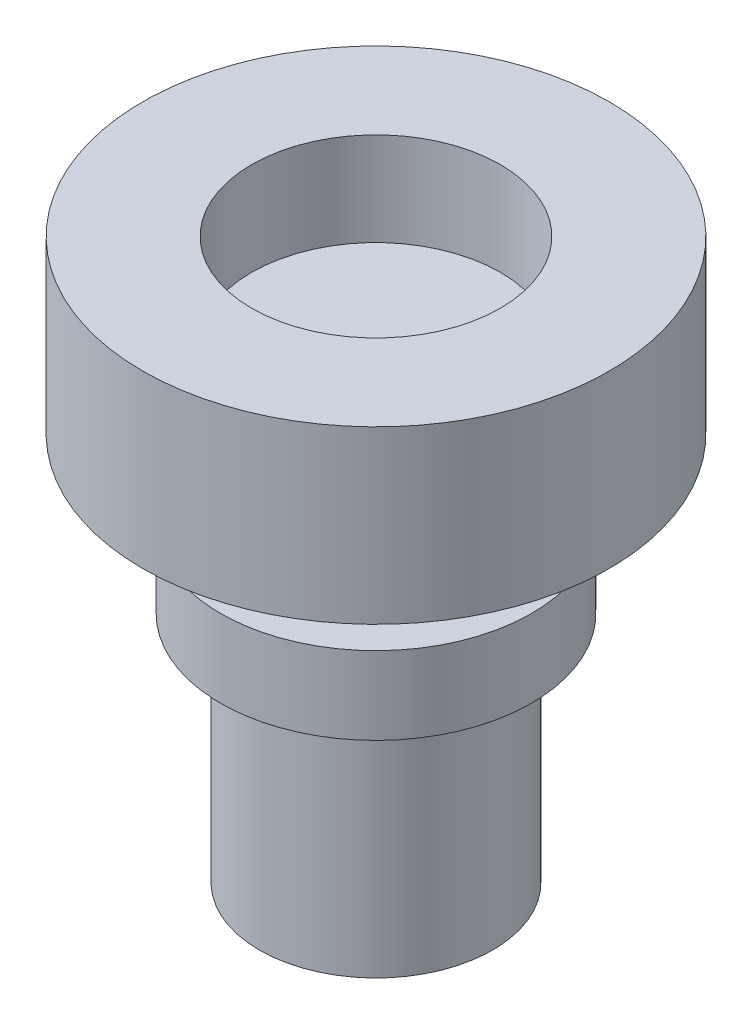
ISO-10303-21;
HEADER;
FILE_DESCRIPTION(('STEP AP214'),'2;1');
FILE_NAME('part.step','',(''),(''),'','','');
FILE_SCHEMA(('AUTOMOTIVE_DESIGN { 1 0 10303 214 1 1 1 1 }'));
ENDSEC;
DATA;
#1=APPLICATION_CONTEXT('core data for automotive mechanical design processes');
#2=APPLICATION_PROTOCOL_DEFINITION('international standard','automotive_design',2000,#1);
#3=PRODUCT_CONTEXT('',#1,'mechanical');
#4=PRODUCT('Part','Part','',(#3));
#5=PRODUCT_RELATED_PRODUCT_CATEGORY('part','',(#4));
#6=PRODUCT_DEFINITION_FORMATION('','',#4);
#7=PRODUCT_DEFINITION_CONTEXT('part definition',#1,'design');
#8=PRODUCT_DEFINITION('design','',#6,#7);
#9=PRODUCT_DEFINITION_SHAPE('','',#8);
#10=(LENGTH_UNIT() NAMED_UNIT(*) SI_UNIT(.MILLI.,.METRE.));
#11=(NAMED_UNIT(*) PLANE_ANGLE_UNIT() SI_UNIT($,.RADIAN.));
#12=(NAMED_UNIT(*) SI_UNIT($,.STERADIAN.) SOLID_ANGLE_UNIT());
#13=UNCERTAINTY_MEASURE_WITH_UNIT(LENGTH_MEASURE(1.E-05),#10,'distance_accuracy_value','');
#14=(GEOMETRIC_REPRESENTATION_CONTEXT(3) GLOBAL_UNCERTAINTY_ASSIGNED_CONTEXT((#13)) GLOBAL_UNIT_ASSIGNED_CONTEXT((#10,
#11,#12)) REPRESENTATION_CONTEXT('',''));
#15=CARTESIAN_POINT('',(0.,0.,0.));
#16=DIRECTION('',(0.,0.,1.));
#17=DIRECTION('',(1.,0.,0.));
#18=AXIS2_PLACEMENT_3D('',#15,#16,#17);
#19=CARTESIAN_POINT('',(-0.522013311509166,2.2,-0.51113803418606));
#20=DIRECTION('',(0.,1.,0.));
#21=DIRECTION('',(0.,0.,1.));
#22=AXIS2_PLACEMENT_3D('',#19,#20,#21);
#23=PLANE('',#22);
#24=CARTESIAN_POINT('',(-0.522013311509166,2.2,-0.51113803418606));
#25=DIRECTION('',(0.,1.,0.));
#26=DIRECTION('',(0.,0.,1.));
#27=AXIS2_PLACEMENT_3D('',#24,#25,#26);
#28=CIRCLE('',#27,3.);
#29=CARTESIAN_POINT('',(-0.522013311509166,2.2,2.48886196581394));
#30=VERTEX_POINT('',#29);
#31=EDGE_CURVE('E79',#30,#30,#28,.T.);
#32=ORIENTED_EDGE('',*,*,#31,.T.);
#33=EDGE_LOOP('',(#32));
#34=FACE_BOUND('',#33,.T.);
#35=CARTESIAN_POINT('',(-0.522013311509166,2.2,-0.51113803418606));
#36=DIRECTION('',(0.,1.,0.));
#37=DIRECTION('',(0.,0.,1.));
#38=AXIS2_PLACEMENT_3D('',#35,#36,#37);
#39=CIRCLE('',#38,1.6);
#40=CARTESIAN_POINT('',(-0.522013311509166,2.2,1.08886196581394));
#41=VERTEX_POINT('',#40);
#42=EDGE_CURVE('E73',#41,#41,#39,.T.);
#43=ORIENTED_EDGE('',*,*,#42,.F.);
#44=EDGE_LOOP('',(#43));
#45=FACE_BOUND('',#44,.T.);
#46=ADVANCED_FACE('F43',(#34,#45),#23,.T.);
#47=CARTESIAN_POINT('',(-0.522013311509166,0.,-0.51113803418606));
#48=DIRECTION('',(0.,1.,0.));
#49=DIRECTION('',(0.,0.,1.));
#50=AXIS2_PLACEMENT_3D('',#47,#48,#49);
#51=PLANE('',#50);
#52=CARTESIAN_POINT('',(-0.522013311509166,0.,-0.51113803418606));
#53=DIRECTION('',(0.,-1.,0.));
#54=DIRECTION('',(0.,0.,-1.));
#55=AXIS2_PLACEMENT_3D('',#52,#53,#54);
#56=CIRCLE('',#55,1.5);
#57=CARTESIAN_POINT('',(-0.522013311509166,0.,-2.01113803418606));
#58=VERTEX_POINT('',#57);
#59=EDGE_CURVE('E52',#58,#58,#56,.T.);
#60=ORIENTED_EDGE('',*,*,#59,.F.);
#61=EDGE_LOOP('',(#60));
#62=FACE_BOUND('',#61,.T.);
#63=CARTESIAN_POINT('',(-0.522013311509166,0.,-0.51113803418606));
#64=DIRECTION('',(0.,1.,0.));
#65=DIRECTION('',(0.,0.,1.));
#66=AXIS2_PLACEMENT_3D('',#63,#64,#65);
#67=CIRCLE('',#66,3.);
#68=CARTESIAN_POINT('',(-0.522013311509166,0.,2.48886196581394));
#69=VERTEX_POINT('',#68);
#70=EDGE_CURVE('E78',#69,#69,#67,.T.);
#71=ORIENTED_EDGE('',*,*,#70,.F.);
#72=EDGE_LOOP('',(#71));
#73=FACE_BOUND('',#72,.T.);
#74=ADVANCED_FACE('F87',(#62,#73),#51,.F.);
#75=CARTESIAN_POINT('',(-0.522013311509166,2.2,-0.51113803418606));
#76=DIRECTION('',(0.,-1.,0.));
#77=DIRECTION('',(0.,0.,-1.));
#78=AXIS2_PLACEMENT_3D('',#75,#76,#77);
#79=CYLINDRICAL_SURFACE('',#78,3.);
#80=ORIENTED_EDGE('',*,*,#31,.F.);
#81=EDGE_LOOP('',(#80));
#82=FACE_BOUND('',#81,.T.);
#83=ORIENTED_EDGE('',*,*,#70,.T.);
#84=EDGE_LOOP('',(#83));
#85=FACE_BOUND('',#84,.T.);
#86=ADVANCED_FACE('F45',(#82,#85),#79,.T.);
#87=CARTESIAN_POINT('',(-0.522013311509166,2.2,-0.51113803418606));
#88=DIRECTION('',(0.,-1.,0.));
#89=DIRECTION('',(0.,0.,-1.));
#90=AXIS2_PLACEMENT_3D('',#87,#88,#89);
#91=CYLINDRICAL_SURFACE('',#90,1.6);
#92=CARTESIAN_POINT('',(-0.522013311509166,1.,-0.51113803418606));
#93=DIRECTION('',(0.,1.,0.));
#94=DIRECTION('',(0.,0.,1.));
#95=AXIS2_PLACEMENT_3D('',#92,#93,#94);
#96=CIRCLE('',#95,1.6);
#97=CARTESIAN_POINT('',(-0.522013311509166,1.,1.08886196581394));
#98=VERTEX_POINT('',#97);
#99=EDGE_CURVE('E47',#98,#98,#96,.T.);
#100=ORIENTED_EDGE('',*,*,#99,.F.);
#101=EDGE_LOOP('',(#100));
#102=FACE_BOUND('',#101,.T.);
#103=ORIENTED_EDGE('',*,*,#42,.T.);
#104=EDGE_LOOP('',(#103));
#105=FACE_BOUND('',#104,.T.);
#106=ADVANCED_FACE('F94',(#102,#105),#91,.F.);
#107=CARTESIAN_POINT('',(0.,1.,0.));
#108=DIRECTION('',(0.,1.,0.));
#109=DIRECTION('',(0.,0.,1.));
#110=AXIS2_PLACEMENT_3D('',#107,#108,#109);
#111=PLANE('',#110);
#112=ORIENTED_EDGE('',*,*,#99,.T.);
#113=EDGE_LOOP('',(#112));
#114=FACE_BOUND('',#113,.T.);
#115=ADVANCED_FACE('F102',(#114),#111,.T.);
#116=CARTESIAN_POINT('',(-0.522013311509166,-1.,-0.51113803418606));
#117=DIRECTION('',(0.,1.,0.));
#118=DIRECTION('',(0.,0.,1.));
#119=AXIS2_PLACEMENT_3D('',#116,#117,#118);
#120=CYLINDRICAL_SURFACE('',#119,1.5);
#121=CARTESIAN_POINT('',(-0.522013311509166,-1.,-0.51113803418606));
#122=DIRECTION('',(0.,-1.,0.));
#123=DIRECTION('',(0.,0.,-1.));
#124=AXIS2_PLACEMENT_3D('',#121,#122,#123);
#125=CIRCLE('',#124,1.5);
#126=CARTESIAN_POINT('',(-0.522013311509166,-1.,-2.01113803418606));
#127=VERTEX_POINT('',#126);
#128=EDGE_CURVE('E66',#127,#127,#125,.T.);
#129=ORIENTED_EDGE('',*,*,#128,.F.);
#130=EDGE_LOOP('',(#129));
#131=FACE_BOUND('',#130,.T.);
#132=ORIENTED_EDGE('',*,*,#59,.T.);
#133=EDGE_LOOP('',(#132));
#134=FACE_BOUND('',#133,.T.);
#135=ADVANCED_FACE('F106',(#131,#134),#120,.T.);
#136=CARTESIAN_POINT('',(-0.522013311509166,-2.,-0.51113803418606));
#137=DIRECTION('',(0.,1.,0.));
#138=DIRECTION('',(0.,0.,1.));
#139=AXIS2_PLACEMENT_3D('',#136,#137,#138);
#140=CYLINDRICAL_SURFACE('',#139,2.);
#141=CARTESIAN_POINT('',(-0.522013311509166,-2.,-0.51113803418606));
#142=DIRECTION('',(0.,-1.,0.));
#143=DIRECTION('',(0.,0.,-1.));
#144=AXIS2_PLACEMENT_3D('',#141,#142,#143);
#145=CIRCLE('',#144,2.);
#146=CARTESIAN_POINT('',(-0.522013311509166,-2.,-2.51113803418606));
#147=VERTEX_POINT('',#146);
#148=EDGE_CURVE('E62',#147,#147,#145,.T.);
#149=ORIENTED_EDGE('',*,*,#148,.F.);
#150=EDGE_LOOP('',(#149));
#151=FACE_BOUND('',#150,.T.);
#152=CARTESIAN_POINT('',(-0.522013311509166,-1.,-0.51113803418606));
#153=DIRECTION('',(0.,-1.,0.));
#154=DIRECTION('',(0.,0.,-1.));
#155=AXIS2_PLACEMENT_3D('',#152,#153,#154);
#156=CIRCLE('',#155,2.);
#157=CARTESIAN_POINT('',(-0.522013311509166,-1.,-2.51113803418606));
#158=VERTEX_POINT('',#157);
#159=EDGE_CURVE('E67',#158,#158,#156,.T.);
#160=ORIENTED_EDGE('',*,*,#159,.T.);
#161=EDGE_LOOP('',(#160));
#162=FACE_BOUND('',#161,.T.);
#163=ADVANCED_FACE('F110',(#151,#162),#140,.T.);
#164=CARTESIAN_POINT('',(-0.522013311509166,-2.,-0.51113803418606));
#165=DIRECTION('',(0.,-1.,0.));
#166=DIRECTION('',(0.,0.,-1.));
#167=AXIS2_PLACEMENT_3D('',#164,#165,#166);
#168=PLANE('',#167);
#169=CARTESIAN_POINT('',(-0.522013311509166,-2.,-0.51113803418606));
#170=DIRECTION('',(0.,-1.,0.));
#171=DIRECTION('',(0.,0.,-1.));
#172=AXIS2_PLACEMENT_3D('',#169,#170,#171);
#173=CIRCLE('',#172,1.5);
#174=CARTESIAN_POINT('',(-0.522013311509166,-2.,-2.01113803418606));
#175=VERTEX_POINT('',#174);
#176=EDGE_CURVE('E10',#175,#175,#173,.T.);
#177=ORIENTED_EDGE('',*,*,#176,.F.);
#178=EDGE_LOOP('',(#177));
#179=FACE_BOUND('',#178,.T.);
#180=ORIENTED_EDGE('',*,*,#148,.T.);
#181=EDGE_LOOP('',(#180));
#182=FACE_BOUND('',#181,.T.);
#183=ADVANCED_FACE('F114',(#179,#182),#168,.T.);
#184=CARTESIAN_POINT('',(-0.522013311509166,-1.,-0.51113803418606));
#185=DIRECTION('',(0.,-1.,0.));
#186=DIRECTION('',(0.,0.,-1.));
#187=AXIS2_PLACEMENT_3D('',#184,#185,#186);
#188=PLANE('',#187);
#189=ORIENTED_EDGE('',*,*,#128,.T.);
#190=EDGE_LOOP('',(#189));
#191=FACE_BOUND('',#190,.T.);
#192=ORIENTED_EDGE('',*,*,#159,.F.);
#193=EDGE_LOOP('',(#192));
#194=FACE_BOUND('',#193,.T.);
#195=ADVANCED_FACE('F116',(#191,#194),#188,.F.);
#196=CARTESIAN_POINT('',(-0.522013311509166,-5.,-0.51113803418606));
#197=DIRECTION('',(0.,1.,0.));
#198=DIRECTION('',(0.,0.,1.));
#199=AXIS2_PLACEMENT_3D('',#196,#197,#198);
#200=CYLINDRICAL_SURFACE('',#199,1.5);
#201=CARTESIAN_POINT('',(-0.522013311509166,-5.,-0.51113803418606));
#202=DIRECTION('',(0.,-1.,0.));
#203=DIRECTION('',(0.,0.,-1.));
#204=AXIS2_PLACEMENT_3D('',#201,#202,#203);
#205=CIRCLE('',#204,1.5);
#206=CARTESIAN_POINT('',(-0.522013311509166,-5.,-2.01113803418606));
#207=VERTEX_POINT('',#206);
#208=EDGE_CURVE('E61',#207,#207,#205,.T.);
#209=ORIENTED_EDGE('',*,*,#208,.F.);
#210=EDGE_LOOP('',(#209));
#211=FACE_BOUND('',#210,.T.);
#212=ORIENTED_EDGE('',*,*,#176,.T.);
#213=EDGE_LOOP('',(#212));
#214=FACE_BOUND('',#213,.T.);
#215=ADVANCED_FACE('F119',(#211,#214),#200,.T.);
#216=CARTESIAN_POINT('',(-0.522013311509166,-5.,-0.51113803418606));
#217=DIRECTION('',(0.,-1.,0.));
#218=DIRECTION('',(0.,0.,-1.));
#219=AXIS2_PLACEMENT_3D('',#216,#217,#218);
#220=PLANE('',#219);
#221=ORIENTED_EDGE('',*,*,#208,.T.);
#222=EDGE_LOOP('',(#221));
#223=FACE_BOUND('',#222,.T.);
#224=ADVANCED_FACE('F126',(#223),#220,.T.);
#225=CLOSED_SHELL('',(#46,#74,#86,#106,#115,#135,#163,#183,#195,#215,#224));
#226=MANIFOLD_SOLID_BREP('B2',#225);
#227=ADVANCED_BREP_SHAPE_REPRESENTATION('',(#18,#226),#14);
#228=SHAPE_DEFINITION_REPRESENTATION(#9,#227);
ENDSEC;
END-ISO-10303-21;
